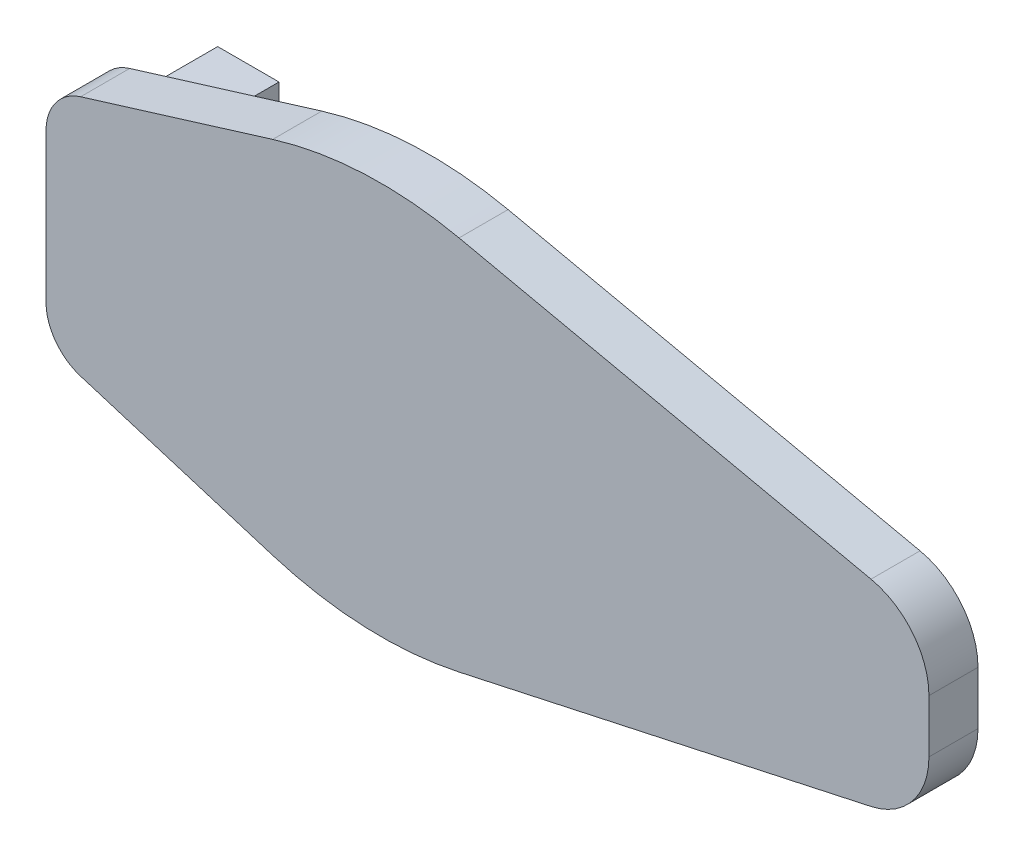
ISO-10303-21;
HEADER;
FILE_DESCRIPTION(('STEP AP214'),'2;1');
FILE_NAME('part.step','',(''),(''),'','','');
FILE_SCHEMA(('AUTOMOTIVE_DESIGN { 1 0 10303 214 1 1 1 1 }'));
ENDSEC;
DATA;
#1=APPLICATION_CONTEXT('core data for automotive mechanical design processes');
#2=APPLICATION_PROTOCOL_DEFINITION('international standard','automotive_design',2000,#1);
#3=PRODUCT_CONTEXT('',#1,'mechanical');
#4=PRODUCT('Part','Part','',(#3));
#5=PRODUCT_RELATED_PRODUCT_CATEGORY('part','',(#4));
#6=PRODUCT_DEFINITION_FORMATION('','',#4);
#7=PRODUCT_DEFINITION_CONTEXT('part definition',#1,'design');
#8=PRODUCT_DEFINITION('design','',#6,#7);
#9=PRODUCT_DEFINITION_SHAPE('','',#8);
#10=(LENGTH_UNIT() NAMED_UNIT(*) SI_UNIT(.MILLI.,.METRE.));
#11=(NAMED_UNIT(*) PLANE_ANGLE_UNIT() SI_UNIT($,.RADIAN.));
#12=(NAMED_UNIT(*) SI_UNIT($,.STERADIAN.) SOLID_ANGLE_UNIT());
#13=UNCERTAINTY_MEASURE_WITH_UNIT(LENGTH_MEASURE(1.E-05),#10,'distance_accuracy_value','');
#14=(GEOMETRIC_REPRESENTATION_CONTEXT(3) GLOBAL_UNCERTAINTY_ASSIGNED_CONTEXT((#13)) GLOBAL_UNIT_ASSIGNED_CONTEXT((#10,
#11,#12)) REPRESENTATION_CONTEXT('',''));
#15=CARTESIAN_POINT('',(0.,0.,0.));
#16=DIRECTION('',(0.,0.,1.));
#17=DIRECTION('',(1.,0.,0.));
#18=AXIS2_PLACEMENT_3D('',#15,#16,#17);
#19=CARTESIAN_POINT('',(27.3089481541044,-13.9852555881266,0.));
#20=DIRECTION('',(0.,0.,1.));
#21=DIRECTION('',(1.,0.,0.));
#22=AXIS2_PLACEMENT_3D('',#19,#20,#21);
#23=PLANE('',#22);
#24=DIRECTION('',(-1.,0.,0.));
#25=VECTOR('',#24,1.);
#26=CARTESIAN_POINT('',(5.,-5.,0.));
#27=LINE('',#26,#25);
#28=CARTESIAN_POINT('',(5.,-5.,0.));
#29=VERTEX_POINT('',#28);
#30=CARTESIAN_POINT('',(0.,-5.,0.));
#31=VERTEX_POINT('',#30);
#32=EDGE_CURVE('E47',#29,#31,#27,.T.);
#33=ORIENTED_EDGE('',*,*,#32,.F.);
#34=DIRECTION('',(0.,-1.,0.));
#35=VECTOR('',#34,1.);
#36=CARTESIAN_POINT('',(5.,-5.,0.));
#37=LINE('',#36,#35);
#38=CARTESIAN_POINT('',(5.,5.,0.));
#39=VERTEX_POINT('',#38);
#40=EDGE_CURVE('E261',#39,#29,#37,.T.);
#41=ORIENTED_EDGE('',*,*,#40,.F.);
#42=DIRECTION('',(1.,0.,0.));
#43=VECTOR('',#42,1.);
#44=CARTESIAN_POINT('',(5.,5.,0.));
#45=LINE('',#44,#43);
#46=CARTESIAN_POINT('',(0.,5.,0.));
#47=VERTEX_POINT('',#46);
#48=EDGE_CURVE('E260',#47,#39,#45,.T.);
#49=ORIENTED_EDGE('',*,*,#48,.F.);
#50=DIRECTION('',(0.,-1.,0.));
#51=VECTOR('',#50,1.);
#52=CARTESIAN_POINT('',(0.,6.04570138192756,0.));
#53=LINE('',#52,#51);
#54=CARTESIAN_POINT('',(0.,6.04570138192756,0.));
#55=VERTEX_POINT('',#54);
#56=EDGE_CURVE('E168',#55,#47,#53,.T.);
#57=ORIENTED_EDGE('',*,*,#56,.F.);
#58=CARTESIAN_POINT('',(4.,6.04570138192756,0.));
#59=DIRECTION('',(0.,0.,1.));
#60=DIRECTION('',(1.,0.,0.));
#61=AXIS2_PLACEMENT_3D('',#58,#59,#60);
#62=CIRCLE('',#61,4.);
#63=CARTESIAN_POINT('',(2.82365660464991,9.86881741681536,0.));
#64=VERTEX_POINT('',#63);
#65=EDGE_CURVE('E206',#64,#55,#62,.T.);
#66=ORIENTED_EDGE('',*,*,#65,.F.);
#67=DIRECTION('',(-0.95577900872195,-0.294085848837522,0.));
#68=VECTOR('',#67,1.);
#69=CARTESIAN_POINT('',(2.82365660464991,9.86881741681536,0.));
#70=LINE('',#69,#68);
#71=CARTESIAN_POINT('',(18.4863726889787,14.6881146735319,0.));
#72=VERTEX_POINT('',#71);
#73=EDGE_CURVE('E172',#72,#64,#70,.T.);
#74=ORIENTED_EDGE('',*,*,#73,.F.);
#75=CARTESIAN_POINT('',(27.3089481541044,-13.9852555881266,0.));
#76=DIRECTION('',(0.,0.,1.));
#77=DIRECTION('',(1.,0.,0.));
#78=AXIS2_PLACEMENT_3D('',#75,#76,#77);
#79=CIRCLE('',#78,30.);
#80=CARTESIAN_POINT('',(33.6818374840357,15.3300353295574,0.));
#81=VERTEX_POINT('',#80);
#82=EDGE_CURVE('E169',#81,#72,#79,.T.);
#83=ORIENTED_EDGE('',*,*,#82,.F.);
#84=DIRECTION('',(-0.977176363922801,0.212429644331044,0.));
#85=VECTOR('',#84,1.);
#86=CARTESIAN_POINT('',(33.6818374840357,15.3300353295574,0.));
#87=LINE('',#86,#85);
#88=CARTESIAN_POINT('',(67.2745778659863,8.02726568130733,0.));
#89=VERTEX_POINT('',#88);
#90=EDGE_CURVE('E182',#89,#81,#87,.T.);
#91=ORIENTED_EDGE('',*,*,#90,.F.);
#92=CARTESIAN_POINT('',(66.,2.16420749777052,0.));
#93=DIRECTION('',(0.,0.,1.));
#94=DIRECTION('',(-1.,0.,0.));
#95=AXIS2_PLACEMENT_3D('',#92,#93,#94);
#96=CIRCLE('',#95,6.00000000000001);
#97=CARTESIAN_POINT('',(72.,2.16420749777052,0.));
#98=VERTEX_POINT('',#97);
#99=EDGE_CURVE('E221',#98,#89,#96,.T.);
#100=ORIENTED_EDGE('',*,*,#99,.F.);
#101=DIRECTION('',(0.,1.,0.));
#102=VECTOR('',#101,1.);
#103=CARTESIAN_POINT('',(72.,2.16420749777052,0.));
#104=LINE('',#103,#102);
#105=CARTESIAN_POINT('',(72.,-2.16420749777052,0.));
#106=VERTEX_POINT('',#105);
#107=EDGE_CURVE('E219',#106,#98,#104,.T.);
#108=ORIENTED_EDGE('',*,*,#107,.F.);
#109=CARTESIAN_POINT('',(66.,-2.16420749777052,0.));
#110=DIRECTION('',(0.,0.,1.));
#111=DIRECTION('',(1.,0.,0.));
#112=AXIS2_PLACEMENT_3D('',#109,#110,#111);
#113=CIRCLE('',#112,6.00000000000001);
#114=CARTESIAN_POINT('',(67.2745778659863,-8.02726568130734,0.));
#115=VERTEX_POINT('',#114);
#116=EDGE_CURVE('E217',#115,#106,#113,.T.);
#117=ORIENTED_EDGE('',*,*,#116,.F.);
#118=DIRECTION('',(0.977176363922801,0.212429644331044,0.));
#119=VECTOR('',#118,1.);
#120=CARTESIAN_POINT('',(33.6818374840357,-15.3300353295574,0.));
#121=LINE('',#120,#119);
#122=CARTESIAN_POINT('',(33.6818374840357,-15.3300353295574,0.));
#123=VERTEX_POINT('',#122);
#124=EDGE_CURVE('E215',#123,#115,#121,.T.);
#125=ORIENTED_EDGE('',*,*,#124,.F.);
#126=CARTESIAN_POINT('',(27.3089481541044,13.9852555881266,0.));
#127=DIRECTION('',(0.,0.,1.));
#128=DIRECTION('',(-1.,0.,0.));
#129=AXIS2_PLACEMENT_3D('',#126,#127,#128);
#130=CIRCLE('',#129,30.);
#131=CARTESIAN_POINT('',(18.4863726889787,-14.6881146735319,0.));
#132=VERTEX_POINT('',#131);
#133=EDGE_CURVE('E213',#132,#123,#130,.T.);
#134=ORIENTED_EDGE('',*,*,#133,.F.);
#135=DIRECTION('',(0.95577900872195,-0.294085848837522,0.));
#136=VECTOR('',#135,1.);
#137=CARTESIAN_POINT('',(2.82365660464991,-9.86881741681536,0.));
#138=LINE('',#137,#136);
#139=CARTESIAN_POINT('',(2.82365660464991,-9.86881741681536,0.));
#140=VERTEX_POINT('',#139);
#141=EDGE_CURVE('E211',#140,#132,#138,.T.);
#142=ORIENTED_EDGE('',*,*,#141,.F.);
#143=CARTESIAN_POINT('',(4.,-6.04570138192756,0.));
#144=DIRECTION('',(0.,0.,1.));
#145=DIRECTION('',(-1.,0.,0.));
#146=AXIS2_PLACEMENT_3D('',#143,#144,#145);
#147=CIRCLE('',#146,4.);
#148=CARTESIAN_POINT('',(0.,-6.04570138192756,0.));
#149=VERTEX_POINT('',#148);
#150=EDGE_CURVE('E209',#149,#140,#147,.T.);
#151=ORIENTED_EDGE('',*,*,#150,.F.);
#152=EDGE_CURVE('E52',#31,#149,#53,.T.);
#153=ORIENTED_EDGE('',*,*,#152,.F.);
#154=EDGE_LOOP('',(#33,#41,#49,#57,#66,#74,#83,#91,#100,#108,#117,#125,#134,#142,#151,#153));
#155=FACE_BOUND('',#154,.T.);
#156=ADVANCED_FACE('F32',(#155),#23,.F.);
#157=CARTESIAN_POINT('',(27.3089481541044,-13.9852555881266,4.));
#158=DIRECTION('',(0.,0.,-1.));
#159=DIRECTION('',(-1.,0.,0.));
#160=AXIS2_PLACEMENT_3D('',#157,#158,#159);
#161=CYLINDRICAL_SURFACE('',#160,30.);
#162=ORIENTED_EDGE('',*,*,#82,.T.);
#163=DIRECTION('',(0.,0.,-1.));
#164=VECTOR('',#163,1.);
#165=CARTESIAN_POINT('',(18.4863726889787,14.6881146735319,4.));
#166=LINE('',#165,#164);
#167=CARTESIAN_POINT('',(18.4863726889787,14.6881146735319,4.));
#168=VERTEX_POINT('',#167);
#169=EDGE_CURVE('E11',#168,#72,#166,.T.);
#170=ORIENTED_EDGE('',*,*,#169,.F.);
#171=CARTESIAN_POINT('',(27.3089481541044,-13.9852555881266,4.));
#172=DIRECTION('',(0.,0.,1.));
#173=DIRECTION('',(1.,0.,0.));
#174=AXIS2_PLACEMENT_3D('',#171,#172,#173);
#175=CIRCLE('',#174,30.);
#176=CARTESIAN_POINT('',(33.6818374840357,15.3300353295574,4.));
#177=VERTEX_POINT('',#176);
#178=EDGE_CURVE('E178',#177,#168,#175,.T.);
#179=ORIENTED_EDGE('',*,*,#178,.F.);
#180=DIRECTION('',(0.,0.,-1.));
#181=VECTOR('',#180,1.);
#182=CARTESIAN_POINT('',(33.6818374840357,15.3300353295574,4.));
#183=LINE('',#182,#181);
#184=EDGE_CURVE('E203',#177,#81,#183,.T.);
#185=ORIENTED_EDGE('',*,*,#184,.T.);
#186=EDGE_LOOP('',(#162,#170,#179,#185));
#187=FACE_BOUND('',#186,.T.);
#188=ADVANCED_FACE('F34',(#187),#161,.T.);
#189=CARTESIAN_POINT('',(2.82365660464991,9.86881741681536,4.));
#190=DIRECTION('',(0.294085848837522,-0.95577900872195,0.));
#191=DIRECTION('',(0.95577900872195,0.294085848837522,0.));
#192=AXIS2_PLACEMENT_3D('',#189,#190,#191);
#193=PLANE('',#192);
#194=ORIENTED_EDGE('',*,*,#73,.T.);
#195=DIRECTION('',(0.,0.,-1.));
#196=VECTOR('',#195,1.);
#197=CARTESIAN_POINT('',(2.82365660464991,9.86881741681536,4.));
#198=LINE('',#197,#196);
#199=CARTESIAN_POINT('',(2.82365660464991,9.86881741681536,4.));
#200=VERTEX_POINT('',#199);
#201=EDGE_CURVE('E40',#200,#64,#198,.T.);
#202=ORIENTED_EDGE('',*,*,#201,.F.);
#203=DIRECTION('',(-0.95577900872195,-0.294085848837522,0.));
#204=VECTOR('',#203,1.);
#205=CARTESIAN_POINT('',(2.82365660464991,9.86881741681536,4.));
#206=LINE('',#205,#204);
#207=EDGE_CURVE('E181',#168,#200,#206,.T.);
#208=ORIENTED_EDGE('',*,*,#207,.F.);
#209=ORIENTED_EDGE('',*,*,#169,.T.);
#210=EDGE_LOOP('',(#194,#202,#208,#209));
#211=FACE_BOUND('',#210,.T.);
#212=ADVANCED_FACE('F300',(#211),#193,.F.);
#213=CARTESIAN_POINT('',(4.,6.04570138192756,4.));
#214=DIRECTION('',(0.,0.,-1.));
#215=DIRECTION('',(-1.,0.,0.));
#216=AXIS2_PLACEMENT_3D('',#213,#214,#215);
#217=CYLINDRICAL_SURFACE('',#216,4.);
#218=ORIENTED_EDGE('',*,*,#65,.T.);
#219=DIRECTION('',(0.,0.,-1.));
#220=VECTOR('',#219,1.);
#221=CARTESIAN_POINT('',(0.,6.04570138192756,4.));
#222=LINE('',#221,#220);
#223=CARTESIAN_POINT('',(0.,6.04570138192756,4.));
#224=VERTEX_POINT('',#223);
#225=EDGE_CURVE('E250',#224,#55,#222,.T.);
#226=ORIENTED_EDGE('',*,*,#225,.F.);
#227=CARTESIAN_POINT('',(4.,6.04570138192756,4.));
#228=DIRECTION('',(0.,0.,1.));
#229=DIRECTION('',(1.,0.,0.));
#230=AXIS2_PLACEMENT_3D('',#227,#228,#229);
#231=CIRCLE('',#230,4.);
#232=EDGE_CURVE('E184',#200,#224,#231,.T.);
#233=ORIENTED_EDGE('',*,*,#232,.F.);
#234=ORIENTED_EDGE('',*,*,#201,.T.);
#235=EDGE_LOOP('',(#218,#226,#233,#234));
#236=FACE_BOUND('',#235,.T.);
#237=ADVANCED_FACE('F256',(#236),#217,.T.);
#238=CARTESIAN_POINT('',(0.,6.04570138192756,4.));
#239=DIRECTION('',(1.,0.,0.));
#240=DIRECTION('',(0.,0.,-1.));
#241=AXIS2_PLACEMENT_3D('',#238,#239,#240);
#242=PLANE('',#241);
#243=CARTESIAN_POINT('',(0.,0.,-5.));
#244=DIRECTION('',(1.,0.,0.));
#245=DIRECTION('',(0.,0.,-1.));
#246=AXIS2_PLACEMENT_3D('',#243,#244,#245);
#247=CIRCLE('',#246,1.55);
#248=CARTESIAN_POINT('',(0.,0.,-6.55));
#249=VERTEX_POINT('',#248);
#250=EDGE_CURVE('E262',#249,#249,#247,.F.);
#251=ORIENTED_EDGE('',*,*,#250,.F.);
#252=EDGE_LOOP('',(#251));
#253=FACE_BOUND('',#252,.T.);
#254=ORIENTED_EDGE('',*,*,#56,.T.);
#255=DIRECTION('',(0.,0.,1.));
#256=VECTOR('',#255,1.);
#257=CARTESIAN_POINT('',(0.,5.,-10.));
#258=LINE('',#257,#256);
#259=CARTESIAN_POINT('',(0.,5.,-10.));
#260=VERTEX_POINT('',#259);
#261=EDGE_CURVE('E148',#260,#47,#258,.T.);
#262=ORIENTED_EDGE('',*,*,#261,.F.);
#263=DIRECTION('',(0.,1.,0.));
#264=VECTOR('',#263,1.);
#265=CARTESIAN_POINT('',(0.,-5.,-10.));
#266=LINE('',#265,#264);
#267=CARTESIAN_POINT('',(0.,-5.,-10.));
#268=VERTEX_POINT('',#267);
#269=EDGE_CURVE('E154',#268,#260,#266,.T.);
#270=ORIENTED_EDGE('',*,*,#269,.F.);
#271=DIRECTION('',(0.,0.,1.));
#272=VECTOR('',#271,1.);
#273=CARTESIAN_POINT('',(0.,-5.,-10.));
#274=LINE('',#273,#272);
#275=EDGE_CURVE('E272',#268,#31,#274,.T.);
#276=ORIENTED_EDGE('',*,*,#275,.T.);
#277=ORIENTED_EDGE('',*,*,#152,.T.);
#278=DIRECTION('',(0.,0.,-1.));
#279=VECTOR('',#278,1.);
#280=CARTESIAN_POINT('',(0.,-6.04570138192756,4.));
#281=LINE('',#280,#279);
#282=CARTESIAN_POINT('',(0.,-6.04570138192756,4.));
#283=VERTEX_POINT('',#282);
#284=EDGE_CURVE('E247',#283,#149,#281,.T.);
#285=ORIENTED_EDGE('',*,*,#284,.F.);
#286=DIRECTION('',(0.,-1.,0.));
#287=VECTOR('',#286,1.);
#288=CARTESIAN_POINT('',(0.,6.04570138192756,4.));
#289=LINE('',#288,#287);
#290=EDGE_CURVE('E186',#224,#283,#289,.T.);
#291=ORIENTED_EDGE('',*,*,#290,.F.);
#292=ORIENTED_EDGE('',*,*,#225,.T.);
#293=EDGE_LOOP('',(#254,#262,#270,#276,#277,#285,#291,#292));
#294=FACE_BOUND('',#293,.T.);
#295=ADVANCED_FACE('F165',(#253,#294),#242,.F.);
#296=CARTESIAN_POINT('',(4.,-6.04570138192756,4.));
#297=DIRECTION('',(0.,0.,-1.));
#298=DIRECTION('',(-1.,0.,0.));
#299=AXIS2_PLACEMENT_3D('',#296,#297,#298);
#300=CYLINDRICAL_SURFACE('',#299,4.);
#301=ORIENTED_EDGE('',*,*,#150,.T.);
#302=DIRECTION('',(0.,0.,-1.));
#303=VECTOR('',#302,1.);
#304=CARTESIAN_POINT('',(2.82365660464991,-9.86881741681536,4.));
#305=LINE('',#304,#303);
#306=CARTESIAN_POINT('',(2.82365660464991,-9.86881741681536,4.));
#307=VERTEX_POINT('',#306);
#308=EDGE_CURVE('E244',#307,#140,#305,.T.);
#309=ORIENTED_EDGE('',*,*,#308,.F.);
#310=CARTESIAN_POINT('',(4.,-6.04570138192756,4.));
#311=DIRECTION('',(0.,0.,1.));
#312=DIRECTION('',(-1.,0.,0.));
#313=AXIS2_PLACEMENT_3D('',#310,#311,#312);
#314=CIRCLE('',#313,4.);
#315=EDGE_CURVE('E188',#283,#307,#314,.T.);
#316=ORIENTED_EDGE('',*,*,#315,.F.);
#317=ORIENTED_EDGE('',*,*,#284,.T.);
#318=EDGE_LOOP('',(#301,#309,#316,#317));
#319=FACE_BOUND('',#318,.T.);
#320=ADVANCED_FACE('F331',(#319),#300,.T.);
#321=CARTESIAN_POINT('',(2.82365660464991,-9.86881741681536,4.));
#322=DIRECTION('',(0.294085848837522,0.95577900872195,0.));
#323=DIRECTION('',(-0.95577900872195,0.294085848837522,0.));
#324=AXIS2_PLACEMENT_3D('',#321,#322,#323);
#325=PLANE('',#324);
#326=ORIENTED_EDGE('',*,*,#141,.T.);
#327=DIRECTION('',(0.,0.,-1.));
#328=VECTOR('',#327,1.);
#329=CARTESIAN_POINT('',(18.4863726889787,-14.6881146735319,4.));
#330=LINE('',#329,#328);
#331=CARTESIAN_POINT('',(18.4863726889787,-14.6881146735319,4.));
#332=VERTEX_POINT('',#331);
#333=EDGE_CURVE('E241',#332,#132,#330,.T.);
#334=ORIENTED_EDGE('',*,*,#333,.F.);
#335=DIRECTION('',(0.95577900872195,-0.294085848837522,0.));
#336=VECTOR('',#335,1.);
#337=CARTESIAN_POINT('',(2.82365660464991,-9.86881741681536,4.));
#338=LINE('',#337,#336);
#339=EDGE_CURVE('E190',#307,#332,#338,.T.);
#340=ORIENTED_EDGE('',*,*,#339,.F.);
#341=ORIENTED_EDGE('',*,*,#308,.T.);
#342=EDGE_LOOP('',(#326,#334,#340,#341));
#343=FACE_BOUND('',#342,.T.);
#344=ADVANCED_FACE('F327',(#343),#325,.F.);
#345=CARTESIAN_POINT('',(27.3089481541044,13.9852555881266,4.));
#346=DIRECTION('',(0.,0.,-1.));
#347=DIRECTION('',(-1.,0.,0.));
#348=AXIS2_PLACEMENT_3D('',#345,#346,#347);
#349=CYLINDRICAL_SURFACE('',#348,30.);
#350=ORIENTED_EDGE('',*,*,#133,.T.);
#351=DIRECTION('',(0.,0.,-1.));
#352=VECTOR('',#351,1.);
#353=CARTESIAN_POINT('',(33.6818374840357,-15.3300353295574,4.));
#354=LINE('',#353,#352);
#355=CARTESIAN_POINT('',(33.6818374840357,-15.3300353295574,4.));
#356=VERTEX_POINT('',#355);
#357=EDGE_CURVE('E238',#356,#123,#354,.T.);
#358=ORIENTED_EDGE('',*,*,#357,.F.);
#359=CARTESIAN_POINT('',(27.3089481541044,13.9852555881266,4.));
#360=DIRECTION('',(0.,0.,1.));
#361=DIRECTION('',(-1.,0.,0.));
#362=AXIS2_PLACEMENT_3D('',#359,#360,#361);
#363=CIRCLE('',#362,30.);
#364=EDGE_CURVE('E192',#332,#356,#363,.T.);
#365=ORIENTED_EDGE('',*,*,#364,.F.);
#366=ORIENTED_EDGE('',*,*,#333,.T.);
#367=EDGE_LOOP('',(#350,#358,#365,#366));
#368=FACE_BOUND('',#367,.T.);
#369=ADVANCED_FACE('F323',(#368),#349,.T.);
#370=CARTESIAN_POINT('',(33.6818374840357,-15.3300353295574,4.));
#371=DIRECTION('',(-0.212429644331044,0.977176363922801,0.));
#372=DIRECTION('',(-0.977176363922801,-0.212429644331044,0.));
#373=AXIS2_PLACEMENT_3D('',#370,#371,#372);
#374=PLANE('',#373);
#375=ORIENTED_EDGE('',*,*,#124,.T.);
#376=DIRECTION('',(0.,0.,-1.));
#377=VECTOR('',#376,1.);
#378=CARTESIAN_POINT('',(67.2745778659863,-8.02726568130734,4.));
#379=LINE('',#378,#377);
#380=CARTESIAN_POINT('',(67.2745778659863,-8.02726568130734,4.));
#381=VERTEX_POINT('',#380);
#382=EDGE_CURVE('E235',#381,#115,#379,.T.);
#383=ORIENTED_EDGE('',*,*,#382,.F.);
#384=DIRECTION('',(0.977176363922801,0.212429644331044,0.));
#385=VECTOR('',#384,1.);
#386=CARTESIAN_POINT('',(33.6818374840357,-15.3300353295574,4.));
#387=LINE('',#386,#385);
#388=EDGE_CURVE('E194',#356,#381,#387,.T.);
#389=ORIENTED_EDGE('',*,*,#388,.F.);
#390=ORIENTED_EDGE('',*,*,#357,.T.);
#391=EDGE_LOOP('',(#375,#383,#389,#390));
#392=FACE_BOUND('',#391,.T.);
#393=ADVANCED_FACE('F319',(#392),#374,.F.);
#394=CARTESIAN_POINT('',(66.,-2.16420749777052,4.));
#395=DIRECTION('',(0.,0.,-1.));
#396=DIRECTION('',(-1.,0.,0.));
#397=AXIS2_PLACEMENT_3D('',#394,#395,#396);
#398=CYLINDRICAL_SURFACE('',#397,6.00000000000001);
#399=ORIENTED_EDGE('',*,*,#116,.T.);
#400=DIRECTION('',(0.,0.,-1.));
#401=VECTOR('',#400,1.);
#402=CARTESIAN_POINT('',(72.,-2.16420749777052,4.));
#403=LINE('',#402,#401);
#404=CARTESIAN_POINT('',(72.,-2.16420749777052,4.));
#405=VERTEX_POINT('',#404);
#406=EDGE_CURVE('E232',#405,#106,#403,.T.);
#407=ORIENTED_EDGE('',*,*,#406,.F.);
#408=CARTESIAN_POINT('',(66.,-2.16420749777052,4.));
#409=DIRECTION('',(0.,0.,1.));
#410=DIRECTION('',(1.,0.,0.));
#411=AXIS2_PLACEMENT_3D('',#408,#409,#410);
#412=CIRCLE('',#411,6.00000000000001);
#413=EDGE_CURVE('E196',#381,#405,#412,.T.);
#414=ORIENTED_EDGE('',*,*,#413,.F.);
#415=ORIENTED_EDGE('',*,*,#382,.T.);
#416=EDGE_LOOP('',(#399,#407,#414,#415));
#417=FACE_BOUND('',#416,.T.);
#418=ADVANCED_FACE('F315',(#417),#398,.T.);
#419=CARTESIAN_POINT('',(72.,2.16420749777052,4.));
#420=DIRECTION('',(-1.,0.,0.));
#421=DIRECTION('',(0.,0.,1.));
#422=AXIS2_PLACEMENT_3D('',#419,#420,#421);
#423=PLANE('',#422);
#424=ORIENTED_EDGE('',*,*,#107,.T.);
#425=DIRECTION('',(0.,0.,-1.));
#426=VECTOR('',#425,1.);
#427=CARTESIAN_POINT('',(72.,2.16420749777052,4.));
#428=LINE('',#427,#426);
#429=CARTESIAN_POINT('',(72.,2.16420749777052,4.));
#430=VERTEX_POINT('',#429);
#431=EDGE_CURVE('E229',#430,#98,#428,.T.);
#432=ORIENTED_EDGE('',*,*,#431,.F.);
#433=DIRECTION('',(0.,1.,0.));
#434=VECTOR('',#433,1.);
#435=CARTESIAN_POINT('',(72.,2.16420749777052,4.));
#436=LINE('',#435,#434);
#437=EDGE_CURVE('E198',#405,#430,#436,.T.);
#438=ORIENTED_EDGE('',*,*,#437,.F.);
#439=ORIENTED_EDGE('',*,*,#406,.T.);
#440=EDGE_LOOP('',(#424,#432,#438,#439));
#441=FACE_BOUND('',#440,.T.);
#442=ADVANCED_FACE('F311',(#441),#423,.F.);
#443=CARTESIAN_POINT('',(66.,2.16420749777052,4.));
#444=DIRECTION('',(0.,0.,-1.));
#445=DIRECTION('',(-1.,0.,0.));
#446=AXIS2_PLACEMENT_3D('',#443,#444,#445);
#447=CYLINDRICAL_SURFACE('',#446,6.00000000000001);
#448=ORIENTED_EDGE('',*,*,#99,.T.);
#449=DIRECTION('',(0.,0.,-1.));
#450=VECTOR('',#449,1.);
#451=CARTESIAN_POINT('',(67.2745778659863,8.02726568130733,4.));
#452=LINE('',#451,#450);
#453=CARTESIAN_POINT('',(67.2745778659863,8.02726568130733,4.));
#454=VERTEX_POINT('',#453);
#455=EDGE_CURVE('E226',#454,#89,#452,.T.);
#456=ORIENTED_EDGE('',*,*,#455,.F.);
#457=CARTESIAN_POINT('',(66.,2.16420749777052,4.));
#458=DIRECTION('',(0.,0.,1.));
#459=DIRECTION('',(-1.,0.,0.));
#460=AXIS2_PLACEMENT_3D('',#457,#458,#459);
#461=CIRCLE('',#460,6.00000000000001);
#462=EDGE_CURVE('E200',#430,#454,#461,.T.);
#463=ORIENTED_EDGE('',*,*,#462,.F.);
#464=ORIENTED_EDGE('',*,*,#431,.T.);
#465=EDGE_LOOP('',(#448,#456,#463,#464));
#466=FACE_BOUND('',#465,.T.);
#467=ADVANCED_FACE('F307',(#466),#447,.T.);
#468=CARTESIAN_POINT('',(33.6818374840357,15.3300353295574,4.));
#469=DIRECTION('',(-0.212429644331044,-0.977176363922801,0.));
#470=DIRECTION('',(0.977176363922801,-0.212429644331044,0.));
#471=AXIS2_PLACEMENT_3D('',#468,#469,#470);
#472=PLANE('',#471);
#473=ORIENTED_EDGE('',*,*,#90,.T.);
#474=ORIENTED_EDGE('',*,*,#184,.F.);
#475=DIRECTION('',(-0.977176363922801,0.212429644331044,0.));
#476=VECTOR('',#475,1.);
#477=CARTESIAN_POINT('',(33.6818374840357,15.3300353295574,4.));
#478=LINE('',#477,#476);
#479=EDGE_CURVE('E202',#454,#177,#478,.T.);
#480=ORIENTED_EDGE('',*,*,#479,.F.);
#481=ORIENTED_EDGE('',*,*,#455,.T.);
#482=EDGE_LOOP('',(#473,#474,#480,#481));
#483=FACE_BOUND('',#482,.T.);
#484=ADVANCED_FACE('F304',(#483),#472,.F.);
#485=CARTESIAN_POINT('',(27.3089481541044,-13.9852555881266,4.));
#486=DIRECTION('',(0.,0.,1.));
#487=DIRECTION('',(1.,0.,0.));
#488=AXIS2_PLACEMENT_3D('',#485,#486,#487);
#489=PLANE('',#488);
#490=ORIENTED_EDGE('',*,*,#178,.T.);
#491=ORIENTED_EDGE('',*,*,#207,.T.);
#492=ORIENTED_EDGE('',*,*,#232,.T.);
#493=ORIENTED_EDGE('',*,*,#290,.T.);
#494=ORIENTED_EDGE('',*,*,#315,.T.);
#495=ORIENTED_EDGE('',*,*,#339,.T.);
#496=ORIENTED_EDGE('',*,*,#364,.T.);
#497=ORIENTED_EDGE('',*,*,#388,.T.);
#498=ORIENTED_EDGE('',*,*,#413,.T.);
#499=ORIENTED_EDGE('',*,*,#437,.T.);
#500=ORIENTED_EDGE('',*,*,#462,.T.);
#501=ORIENTED_EDGE('',*,*,#479,.T.);
#502=EDGE_LOOP('',(#490,#491,#492,#493,#494,#495,#496,#497,#498,#499,#500,#501));
#503=FACE_BOUND('',#502,.T.);
#504=ADVANCED_FACE('F293',(#503),#489,.T.);
#505=CARTESIAN_POINT('',(5.,5.,-10.));
#506=DIRECTION('',(0.,-1.,0.));
#507=DIRECTION('',(0.,0.,-1.));
#508=AXIS2_PLACEMENT_3D('',#505,#506,#507);
#509=PLANE('',#508);
#510=ORIENTED_EDGE('',*,*,#48,.T.);
#511=DIRECTION('',(0.,0.,1.));
#512=VECTOR('',#511,1.);
#513=CARTESIAN_POINT('',(5.,5.,-10.));
#514=LINE('',#513,#512);
#515=CARTESIAN_POINT('',(5.,5.,-10.));
#516=VERTEX_POINT('',#515);
#517=EDGE_CURVE('E150',#516,#39,#514,.T.);
#518=ORIENTED_EDGE('',*,*,#517,.F.);
#519=DIRECTION('',(1.,0.,0.));
#520=VECTOR('',#519,1.);
#521=CARTESIAN_POINT('',(5.,5.,-10.));
#522=LINE('',#521,#520);
#523=EDGE_CURVE('E143',#260,#516,#522,.T.);
#524=ORIENTED_EDGE('',*,*,#523,.F.);
#525=ORIENTED_EDGE('',*,*,#261,.T.);
#526=EDGE_LOOP('',(#510,#518,#524,#525));
#527=FACE_BOUND('',#526,.T.);
#528=ADVANCED_FACE('F146',(#527),#509,.F.);
#529=CARTESIAN_POINT('',(5.,-5.,-10.));
#530=DIRECTION('',(-1.,0.,0.));
#531=DIRECTION('',(0.,0.,1.));
#532=AXIS2_PLACEMENT_3D('',#529,#530,#531);
#533=PLANE('',#532);
#534=CARTESIAN_POINT('',(5.,0.,-5.));
#535=DIRECTION('',(1.,0.,0.));
#536=DIRECTION('',(0.,0.,-1.));
#537=AXIS2_PLACEMENT_3D('',#534,#535,#536);
#538=CIRCLE('',#537,1.55);
#539=CARTESIAN_POINT('',(5.,0.,-6.55));
#540=VERTEX_POINT('',#539);
#541=EDGE_CURVE('E266',#540,#540,#538,.T.);
#542=ORIENTED_EDGE('',*,*,#541,.F.);
#543=EDGE_LOOP('',(#542));
#544=FACE_BOUND('',#543,.T.);
#545=ORIENTED_EDGE('',*,*,#40,.T.);
#546=DIRECTION('',(0.,0.,1.));
#547=VECTOR('',#546,1.);
#548=CARTESIAN_POINT('',(5.,-5.,-10.));
#549=LINE('',#548,#547);
#550=CARTESIAN_POINT('',(5.,-5.,-10.));
#551=VERTEX_POINT('',#550);
#552=EDGE_CURVE('E174',#551,#29,#549,.T.);
#553=ORIENTED_EDGE('',*,*,#552,.F.);
#554=DIRECTION('',(0.,-1.,0.));
#555=VECTOR('',#554,1.);
#556=CARTESIAN_POINT('',(5.,-5.,-10.));
#557=LINE('',#556,#555);
#558=EDGE_CURVE('E153',#516,#551,#557,.T.);
#559=ORIENTED_EDGE('',*,*,#558,.F.);
#560=ORIENTED_EDGE('',*,*,#517,.T.);
#561=EDGE_LOOP('',(#545,#553,#559,#560));
#562=FACE_BOUND('',#561,.T.);
#563=ADVANCED_FACE('F278',(#544,#562),#533,.F.);
#564=CARTESIAN_POINT('',(5.,-5.,-10.));
#565=DIRECTION('',(0.,1.,0.));
#566=DIRECTION('',(-1.,0.,0.));
#567=AXIS2_PLACEMENT_3D('',#564,#565,#566);
#568=PLANE('',#567);
#569=ORIENTED_EDGE('',*,*,#32,.T.);
#570=ORIENTED_EDGE('',*,*,#275,.F.);
#571=DIRECTION('',(-1.,0.,0.));
#572=VECTOR('',#571,1.);
#573=CARTESIAN_POINT('',(5.,-5.,-10.));
#574=LINE('',#573,#572);
#575=EDGE_CURVE('E159',#551,#268,#574,.T.);
#576=ORIENTED_EDGE('',*,*,#575,.F.);
#577=ORIENTED_EDGE('',*,*,#552,.T.);
#578=EDGE_LOOP('',(#569,#570,#576,#577));
#579=FACE_BOUND('',#578,.T.);
#580=ADVANCED_FACE('F276',(#579),#568,.F.);
#581=CARTESIAN_POINT('',(0.,0.,-10.));
#582=DIRECTION('',(0.,0.,1.));
#583=DIRECTION('',(1.,0.,0.));
#584=AXIS2_PLACEMENT_3D('',#581,#582,#583);
#585=PLANE('',#584);
#586=ORIENTED_EDGE('',*,*,#269,.T.);
#587=ORIENTED_EDGE('',*,*,#523,.T.);
#588=ORIENTED_EDGE('',*,*,#558,.T.);
#589=ORIENTED_EDGE('',*,*,#575,.T.);
#590=EDGE_LOOP('',(#586,#587,#588,#589));
#591=FACE_BOUND('',#590,.T.);
#592=ADVANCED_FACE('F157',(#591),#585,.F.);
#593=CARTESIAN_POINT('',(-0.00100000000000013,0.,-5.));
#594=DIRECTION('',(1.,0.,0.));
#595=DIRECTION('',(0.,0.,-1.));
#596=AXIS2_PLACEMENT_3D('',#593,#594,#595);
#597=CYLINDRICAL_SURFACE('',#596,1.55);
#598=ORIENTED_EDGE('',*,*,#541,.T.);
#599=EDGE_LOOP('',(#598));
#600=FACE_BOUND('',#599,.T.);
#601=ORIENTED_EDGE('',*,*,#250,.T.);
#602=EDGE_LOOP('',(#601));
#603=FACE_BOUND('',#602,.T.);
#604=ADVANCED_FACE('F283',(#600,#603),#597,.F.);
#605=CLOSED_SHELL('',(#156,#188,#212,#237,#295,#320,#344,#369,#393,#418,#442,#467,#484,#504,
#528,#563,#580,#592,#604));
#606=MANIFOLD_SOLID_BREP('B2',#605);
#607=ADVANCED_BREP_SHAPE_REPRESENTATION('',(#18,#606),#14);
#608=SHAPE_DEFINITION_REPRESENTATION(#9,#607);
ENDSEC;
END-ISO-10303-21;
